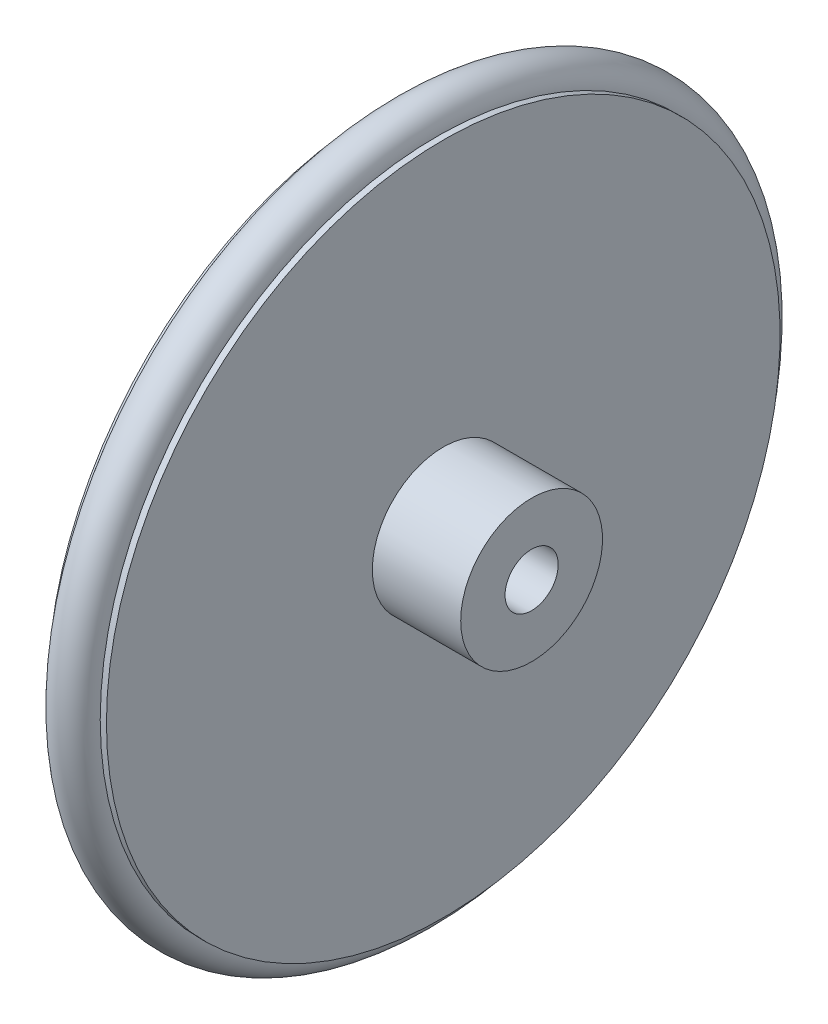
ISO-10303-21;
HEADER;
FILE_DESCRIPTION(('STEP AP214'),'2;1');
FILE_NAME('part.step','',(''),(''),'','','');
FILE_SCHEMA(('AUTOMOTIVE_DESIGN { 1 0 10303 214 1 1 1 1 }'));
ENDSEC;
DATA;
#1=APPLICATION_CONTEXT('core data for automotive mechanical design processes');
#2=APPLICATION_PROTOCOL_DEFINITION('international standard','automotive_design',2000,#1);
#3=PRODUCT_CONTEXT('',#1,'mechanical');
#4=PRODUCT('Part','Part','',(#3));
#5=PRODUCT_RELATED_PRODUCT_CATEGORY('part','',(#4));
#6=PRODUCT_DEFINITION_FORMATION('','',#4);
#7=PRODUCT_DEFINITION_CONTEXT('part definition',#1,'design');
#8=PRODUCT_DEFINITION('design','',#6,#7);
#9=PRODUCT_DEFINITION_SHAPE('','',#8);
#10=(LENGTH_UNIT() NAMED_UNIT(*) SI_UNIT(.MILLI.,.METRE.));
#11=(NAMED_UNIT(*) PLANE_ANGLE_UNIT() SI_UNIT($,.RADIAN.));
#12=(NAMED_UNIT(*) SI_UNIT($,.STERADIAN.) SOLID_ANGLE_UNIT());
#13=UNCERTAINTY_MEASURE_WITH_UNIT(LENGTH_MEASURE(1.E-05),#10,'distance_accuracy_value','');
#14=(GEOMETRIC_REPRESENTATION_CONTEXT(3) GLOBAL_UNCERTAINTY_ASSIGNED_CONTEXT((#13)) GLOBAL_UNIT_ASSIGNED_CONTEXT((#10,
#11,#12)) REPRESENTATION_CONTEXT('',''));
#15=CARTESIAN_POINT('',(0.,0.,0.));
#16=DIRECTION('',(0.,0.,1.));
#17=DIRECTION('',(1.,0.,0.));
#18=AXIS2_PLACEMENT_3D('',#15,#16,#17);
#19=CARTESIAN_POINT('',(3.30000000000003,0.,0.));
#20=DIRECTION('',(-1.,0.,0.));
#21=DIRECTION('',(0.,0.,1.));
#22=AXIS2_PLACEMENT_3D('',#19,#20,#21);
#23=TOROIDAL_SURFACE('',#22,38.,2.5);
#24=CARTESIAN_POINT('',(3.30000000000003,38.,0.));
#25=DIRECTION('',(0.,0.,1.));
#26=DIRECTION('',(1.,0.,0.));
#27=AXIS2_PLACEMENT_3D('',#24,#25,#26);
#28=CIRCLE('',#27,2.5);
#29=CARTESIAN_POINT('',(3.30000000000003,40.5,0.));
#30=VERTEX_POINT('',#29);
#31=EDGE_CURVE('E11',#30,#30,#28,.T.);
#32=CARTESIAN_POINT('',(3.30000000000003,0.,0.));
#33=DIRECTION('',(-1.,0.,0.));
#34=DIRECTION('',(0.,0.,1.));
#35=AXIS2_PLACEMENT_3D('',#32,#33,#34);
#36=CIRCLE('',#35,40.5);
#37=EDGE_CURVE('',#30,#30,#36,.T.);
#38=ORIENTED_EDGE('',*,*,#31,.F.);
#39=ORIENTED_EDGE('',*,*,#31,.T.);
#40=ORIENTED_EDGE('',*,*,#37,.T.);
#41=ORIENTED_EDGE('',*,*,#37,.F.);
#42=EDGE_LOOP('',(#38,#40,#39,#41));
#43=FACE_BOUND('',#42,.T.);
#44=ADVANCED_FACE('F42',(#43),#23,.T.);
#45=CLOSED_SHELL('',(#44));
#46=MANIFOLD_SOLID_BREP('B2',#45);
#47=CARTESIAN_POINT('',(0.,38.,0.));
#48=DIRECTION('',(1.,0.,0.));
#49=DIRECTION('',(0.,0.,-1.));
#50=AXIS2_PLACEMENT_3D('',#47,#48,#49);
#51=PLANE('',#50);
#52=CARTESIAN_POINT('',(0.,0.,0.));
#53=DIRECTION('',(1.,0.,0.));
#54=DIRECTION('',(0.,0.,-1.));
#55=AXIS2_PLACEMENT_3D('',#52,#53,#54);
#56=CIRCLE('',#55,3.);
#57=CARTESIAN_POINT('',(0.,0.,-3.));
#58=VERTEX_POINT('',#57);
#59=EDGE_CURVE('E102',#58,#58,#56,.T.);
#60=ORIENTED_EDGE('',*,*,#59,.T.);
#61=EDGE_LOOP('',(#60));
#62=FACE_BOUND('',#61,.T.);
#63=CARTESIAN_POINT('',(0.,0.,0.));
#64=DIRECTION('',(-1.,0.,0.));
#65=DIRECTION('',(0.,0.,1.));
#66=AXIS2_PLACEMENT_3D('',#63,#64,#65);
#67=CIRCLE('',#66,38.);
#68=CARTESIAN_POINT('',(0.,0.,38.));
#69=VERTEX_POINT('',#68);
#70=EDGE_CURVE('E99',#69,#69,#67,.T.);
#71=ORIENTED_EDGE('',*,*,#70,.T.);
#72=EDGE_LOOP('',(#71));
#73=FACE_BOUND('',#72,.T.);
#74=ADVANCED_FACE('F71',(#62,#73),#51,.F.);
#75=CARTESIAN_POINT('',(16.57,0.,0.));
#76=DIRECTION('',(-1.,0.,0.));
#77=DIRECTION('',(0.,0.,1.));
#78=AXIS2_PLACEMENT_3D('',#75,#76,#77);
#79=PLANE('',#78);
#80=CARTESIAN_POINT('',(16.57,0.,0.));
#81=DIRECTION('',(1.,0.,0.));
#82=DIRECTION('',(0.,0.,-1.));
#83=AXIS2_PLACEMENT_3D('',#80,#81,#82);
#84=CIRCLE('',#83,3.);
#85=CARTESIAN_POINT('',(16.57,0.,-3.));
#86=VERTEX_POINT('',#85);
#87=EDGE_CURVE('E103',#86,#86,#84,.T.);
#88=ORIENTED_EDGE('',*,*,#87,.F.);
#89=EDGE_LOOP('',(#88));
#90=FACE_BOUND('',#89,.T.);
#91=CARTESIAN_POINT('',(16.57,0.,0.));
#92=DIRECTION('',(-1.,0.,0.));
#93=DIRECTION('',(0.,0.,1.));
#94=AXIS2_PLACEMENT_3D('',#91,#92,#93);
#95=CIRCLE('',#94,8.);
#96=CARTESIAN_POINT('',(16.57,0.,8.));
#97=VERTEX_POINT('',#96);
#98=EDGE_CURVE('E41',#97,#97,#95,.T.);
#99=ORIENTED_EDGE('',*,*,#98,.F.);
#100=EDGE_LOOP('',(#99));
#101=FACE_BOUND('',#100,.T.);
#102=ADVANCED_FACE('F118',(#90,#101),#79,.F.);
#103=CARTESIAN_POINT('',(-19.9450853035614,0.,0.));
#104=DIRECTION('',(-1.,0.,0.));
#105=DIRECTION('',(0.,0.,1.));
#106=AXIS2_PLACEMENT_3D('',#103,#104,#105);
#107=CYLINDRICAL_SURFACE('',#106,8.);
#108=CARTESIAN_POINT('',(6.6,0.,0.));
#109=DIRECTION('',(-1.,0.,0.));
#110=DIRECTION('',(0.,0.,1.));
#111=AXIS2_PLACEMENT_3D('',#108,#109,#110);
#112=CIRCLE('',#111,8.);
#113=CARTESIAN_POINT('',(6.6,0.,8.));
#114=VERTEX_POINT('',#113);
#115=EDGE_CURVE('E77',#114,#114,#112,.T.);
#116=ORIENTED_EDGE('',*,*,#115,.F.);
#117=EDGE_LOOP('',(#116));
#118=FACE_BOUND('',#117,.T.);
#119=ORIENTED_EDGE('',*,*,#98,.T.);
#120=EDGE_LOOP('',(#119));
#121=FACE_BOUND('',#120,.T.);
#122=ADVANCED_FACE('F121',(#118,#121),#107,.T.);
#123=CARTESIAN_POINT('',(6.6,8.,0.));
#124=DIRECTION('',(-1.,0.,0.));
#125=DIRECTION('',(0.,0.,1.));
#126=AXIS2_PLACEMENT_3D('',#123,#124,#125);
#127=PLANE('',#126);
#128=CARTESIAN_POINT('',(6.6,0.,0.));
#129=DIRECTION('',(-1.,0.,0.));
#130=DIRECTION('',(0.,0.,1.));
#131=AXIS2_PLACEMENT_3D('',#128,#129,#130);
#132=CIRCLE('',#131,38.);
#133=CARTESIAN_POINT('',(6.6,0.,38.));
#134=VERTEX_POINT('',#133);
#135=EDGE_CURVE('E81',#134,#134,#132,.T.);
#136=ORIENTED_EDGE('',*,*,#135,.F.);
#137=EDGE_LOOP('',(#136));
#138=FACE_BOUND('',#137,.T.);
#139=ORIENTED_EDGE('',*,*,#115,.T.);
#140=EDGE_LOOP('',(#139));
#141=FACE_BOUND('',#140,.T.);
#142=ADVANCED_FACE('F126',(#138,#141),#127,.F.);
#143=CARTESIAN_POINT('',(-19.9450853035614,0.,0.));
#144=DIRECTION('',(-1.,0.,0.));
#145=DIRECTION('',(0.,0.,1.));
#146=AXIS2_PLACEMENT_3D('',#143,#144,#145);
#147=CYLINDRICAL_SURFACE('',#146,38.);
#148=CARTESIAN_POINT('',(5.9,0.,0.));
#149=DIRECTION('',(-1.,0.,0.));
#150=DIRECTION('',(0.,0.,1.));
#151=AXIS2_PLACEMENT_3D('',#148,#149,#150);
#152=CIRCLE('',#151,38.);
#153=CARTESIAN_POINT('',(5.9,0.,38.));
#154=VERTEX_POINT('',#153);
#155=EDGE_CURVE('E85',#154,#154,#152,.T.);
#156=ORIENTED_EDGE('',*,*,#155,.F.);
#157=EDGE_LOOP('',(#156));
#158=FACE_BOUND('',#157,.T.);
#159=ORIENTED_EDGE('',*,*,#135,.T.);
#160=EDGE_LOOP('',(#159));
#161=FACE_BOUND('',#160,.T.);
#162=ADVANCED_FACE('F132',(#158,#161),#147,.T.);
#163=CARTESIAN_POINT('',(5.90000000000003,38.,0.));
#164=DIRECTION('',(1.,0.,0.));
#165=DIRECTION('',(0.,0.,-1.));
#166=AXIS2_PLACEMENT_3D('',#163,#164,#165);
#167=PLANE('',#166);
#168=CARTESIAN_POINT('',(5.90000000000004,0.,0.));
#169=DIRECTION('',(-1.,0.,0.));
#170=DIRECTION('',(0.,0.,1.));
#171=AXIS2_PLACEMENT_3D('',#168,#169,#170);
#172=CIRCLE('',#171,35.);
#173=CARTESIAN_POINT('',(5.90000000000004,0.,35.));
#174=VERTEX_POINT('',#173);
#175=EDGE_CURVE('E90',#174,#174,#172,.T.);
#176=ORIENTED_EDGE('',*,*,#175,.F.);
#177=EDGE_LOOP('',(#176));
#178=FACE_BOUND('',#177,.T.);
#179=ORIENTED_EDGE('',*,*,#155,.T.);
#180=EDGE_LOOP('',(#179));
#181=FACE_BOUND('',#180,.T.);
#182=ADVANCED_FACE('F136',(#178,#181),#167,.F.);
#183=CARTESIAN_POINT('',(-19.9450853035614,0.,0.));
#184=DIRECTION('',(-1.,0.,0.));
#185=DIRECTION('',(0.,0.,1.));
#186=AXIS2_PLACEMENT_3D('',#183,#184,#185);
#187=CYLINDRICAL_SURFACE('',#186,35.);
#188=CARTESIAN_POINT('',(0.700000000000041,0.,0.));
#189=DIRECTION('',(-1.,0.,0.));
#190=DIRECTION('',(0.,0.,1.));
#191=AXIS2_PLACEMENT_3D('',#188,#189,#190);
#192=CIRCLE('',#191,35.);
#193=CARTESIAN_POINT('',(0.700000000000041,0.,35.));
#194=VERTEX_POINT('',#193);
#195=EDGE_CURVE('E93',#194,#194,#192,.T.);
#196=ORIENTED_EDGE('',*,*,#195,.F.);
#197=EDGE_LOOP('',(#196));
#198=FACE_BOUND('',#197,.T.);
#199=ORIENTED_EDGE('',*,*,#175,.T.);
#200=EDGE_LOOP('',(#199));
#201=FACE_BOUND('',#200,.T.);
#202=ADVANCED_FACE('F140',(#198,#201),#187,.T.);
#203=CARTESIAN_POINT('',(0.700000000000042,35.,0.));
#204=DIRECTION('',(-1.,0.,0.));
#205=DIRECTION('',(0.,0.,1.));
#206=AXIS2_PLACEMENT_3D('',#203,#204,#205);
#207=PLANE('',#206);
#208=CARTESIAN_POINT('',(0.700000000000041,0.,0.));
#209=DIRECTION('',(-1.,0.,0.));
#210=DIRECTION('',(0.,0.,1.));
#211=AXIS2_PLACEMENT_3D('',#208,#209,#210);
#212=CIRCLE('',#211,38.);
#213=CARTESIAN_POINT('',(0.700000000000041,0.,38.));
#214=VERTEX_POINT('',#213);
#215=EDGE_CURVE('E96',#214,#214,#212,.T.);
#216=ORIENTED_EDGE('',*,*,#215,.F.);
#217=EDGE_LOOP('',(#216));
#218=FACE_BOUND('',#217,.T.);
#219=ORIENTED_EDGE('',*,*,#195,.T.);
#220=EDGE_LOOP('',(#219));
#221=FACE_BOUND('',#220,.T.);
#222=ADVANCED_FACE('F144',(#218,#221),#207,.F.);
#223=CARTESIAN_POINT('',(-19.9450853035614,0.,0.));
#224=DIRECTION('',(-1.,0.,0.));
#225=DIRECTION('',(0.,0.,1.));
#226=AXIS2_PLACEMENT_3D('',#223,#224,#225);
#227=CYLINDRICAL_SURFACE('',#226,38.);
#228=ORIENTED_EDGE('',*,*,#70,.F.);
#229=EDGE_LOOP('',(#228));
#230=FACE_BOUND('',#229,.T.);
#231=ORIENTED_EDGE('',*,*,#215,.T.);
#232=EDGE_LOOP('',(#231));
#233=FACE_BOUND('',#232,.T.);
#234=ADVANCED_FACE('F114',(#230,#233),#227,.T.);
#235=CARTESIAN_POINT('',(0.,0.,0.));
#236=DIRECTION('',(1.,0.,0.));
#237=DIRECTION('',(0.,0.,-1.));
#238=AXIS2_PLACEMENT_3D('',#235,#236,#237);
#239=CYLINDRICAL_SURFACE('',#238,3.);
#240=ORIENTED_EDGE('',*,*,#59,.F.);
#241=EDGE_LOOP('',(#240));
#242=FACE_BOUND('',#241,.T.);
#243=ORIENTED_EDGE('',*,*,#87,.T.);
#244=EDGE_LOOP('',(#243));
#245=FACE_BOUND('',#244,.T.);
#246=ADVANCED_FACE('F111',(#242,#245),#239,.F.);
#247=CLOSED_SHELL('',(#74,#102,#122,#142,#162,#182,#202,#222,#234,#246));
#248=MANIFOLD_SOLID_BREP('B6',#247);
#249=ADVANCED_BREP_SHAPE_REPRESENTATION('',(#18,#46,#248),#14);
#250=SHAPE_DEFINITION_REPRESENTATION(#9,#249);
ENDSEC;
END-ISO-10303-21;
